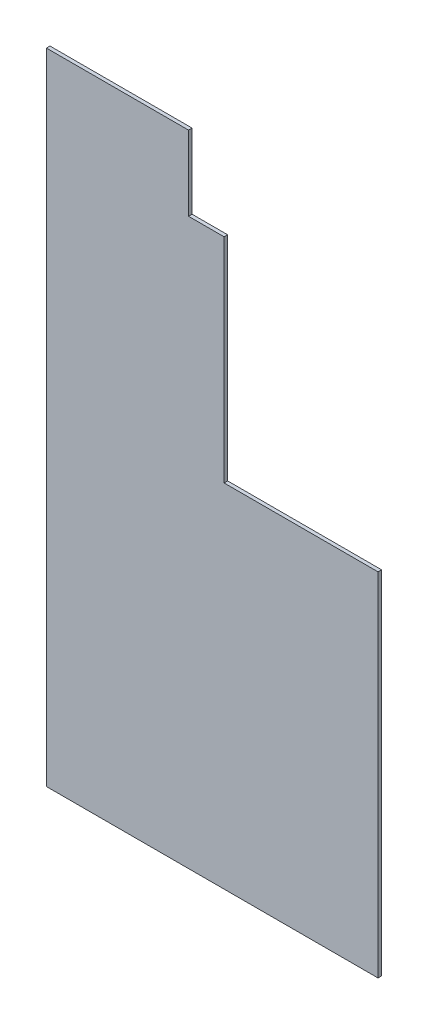
ISO-10303-21;
HEADER;
FILE_DESCRIPTION(('STEP AP214'),'2;1');
FILE_NAME('part.step','',(''),(''),'','','');
FILE_SCHEMA(('AUTOMOTIVE_DESIGN { 1 0 10303 214 1 1 1 1 }'));
ENDSEC;
DATA;
#1=APPLICATION_CONTEXT('core data for automotive mechanical design processes');
#2=APPLICATION_PROTOCOL_DEFINITION('international standard','automotive_design',2000,#1);
#3=PRODUCT_CONTEXT('',#1,'mechanical');
#4=PRODUCT('Part','Part','',(#3));
#5=PRODUCT_RELATED_PRODUCT_CATEGORY('part','',(#4));
#6=PRODUCT_DEFINITION_FORMATION('','',#4);
#7=PRODUCT_DEFINITION_CONTEXT('part definition',#1,'design');
#8=PRODUCT_DEFINITION('design','',#6,#7);
#9=PRODUCT_DEFINITION_SHAPE('','',#8);
#10=(LENGTH_UNIT() NAMED_UNIT(*) SI_UNIT(.MILLI.,.METRE.));
#11=(NAMED_UNIT(*) PLANE_ANGLE_UNIT() SI_UNIT($,.RADIAN.));
#12=(NAMED_UNIT(*) SI_UNIT($,.STERADIAN.) SOLID_ANGLE_UNIT());
#13=UNCERTAINTY_MEASURE_WITH_UNIT(LENGTH_MEASURE(1.E-05),#10,'distance_accuracy_value','');
#14=(GEOMETRIC_REPRESENTATION_CONTEXT(3) GLOBAL_UNCERTAINTY_ASSIGNED_CONTEXT((#13)) GLOBAL_UNIT_ASSIGNED_CONTEXT((#10,
#11,#12)) REPRESENTATION_CONTEXT('',''));
#15=CARTESIAN_POINT('',(0.,0.,0.));
#16=DIRECTION('',(0.,0.,1.));
#17=DIRECTION('',(1.,0.,0.));
#18=AXIS2_PLACEMENT_3D('',#15,#16,#17);
#19=CARTESIAN_POINT('',(-51.5388987090363,86.813499077883,3.));
#20=DIRECTION('',(1.,0.,0.));
#21=DIRECTION('',(0.,1.,0.));
#22=AXIS2_PLACEMENT_3D('',#19,#20,#21);
#23=PLANE('',#22);
#24=DIRECTION('',(0.,-1.,0.));
#25=VECTOR('',#24,1.);
#26=CARTESIAN_POINT('',(-51.5388987090363,86.813499077883,0.));
#27=LINE('',#26,#25);
#28=CARTESIAN_POINT('',(-51.5388987090363,86.813499077883,0.));
#29=VERTEX_POINT('',#28);
#30=CARTESIAN_POINT('',(-51.5388987090362,-453.186500922117,0.));
#31=VERTEX_POINT('',#30);
#32=EDGE_CURVE('E129',#29,#31,#27,.T.);
#33=ORIENTED_EDGE('',*,*,#32,.T.);
#34=DIRECTION('',(0.,0.,-1.));
#35=VECTOR('',#34,1.);
#36=CARTESIAN_POINT('',(-51.5388987090362,-453.186500922117,3.));
#37=LINE('',#36,#35);
#38=CARTESIAN_POINT('',(-51.5388987090362,-453.186500922117,3.));
#39=VERTEX_POINT('',#38);
#40=EDGE_CURVE('E11',#39,#31,#37,.T.);
#41=ORIENTED_EDGE('',*,*,#40,.F.);
#42=DIRECTION('',(0.,-1.,0.));
#43=VECTOR('',#42,1.);
#44=CARTESIAN_POINT('',(-51.5388987090363,86.813499077883,3.));
#45=LINE('',#44,#43);
#46=CARTESIAN_POINT('',(-51.5388987090363,86.813499077883,3.));
#47=VERTEX_POINT('',#46);
#48=EDGE_CURVE('E143',#47,#39,#45,.T.);
#49=ORIENTED_EDGE('',*,*,#48,.F.);
#50=DIRECTION('',(0.,0.,-1.));
#51=VECTOR('',#50,1.);
#52=CARTESIAN_POINT('',(-51.5388987090363,86.813499077883,3.));
#53=LINE('',#52,#51);
#54=EDGE_CURVE('E125',#47,#29,#53,.T.);
#55=ORIENTED_EDGE('',*,*,#54,.T.);
#56=EDGE_LOOP('',(#33,#41,#49,#55));
#57=FACE_BOUND('',#56,.T.);
#58=ADVANCED_FACE('F33',(#57),#23,.F.);
#59=CARTESIAN_POINT('',(-51.5388987090362,-453.186500922117,3.));
#60=DIRECTION('',(0.,1.,0.));
#61=DIRECTION('',(0.,0.,1.));
#62=AXIS2_PLACEMENT_3D('',#59,#60,#61);
#63=PLANE('',#62);
#64=DIRECTION('',(1.,0.,0.));
#65=VECTOR('',#64,1.);
#66=CARTESIAN_POINT('',(-51.5388987090362,-453.186500922117,0.));
#67=LINE('',#66,#65);
#68=CARTESIAN_POINT('',(228.461101290964,-453.186500922117,0.));
#69=VERTEX_POINT('',#68);
#70=EDGE_CURVE('E132',#31,#69,#67,.T.);
#71=ORIENTED_EDGE('',*,*,#70,.T.);
#72=DIRECTION('',(0.,0.,-1.));
#73=VECTOR('',#72,1.);
#74=CARTESIAN_POINT('',(228.461101290964,-453.186500922117,3.));
#75=LINE('',#74,#73);
#76=CARTESIAN_POINT('',(228.461101290964,-453.186500922117,3.));
#77=VERTEX_POINT('',#76);
#78=EDGE_CURVE('E41',#77,#69,#75,.T.);
#79=ORIENTED_EDGE('',*,*,#78,.F.);
#80=DIRECTION('',(1.,0.,0.));
#81=VECTOR('',#80,1.);
#82=CARTESIAN_POINT('',(-51.5388987090362,-453.186500922117,3.));
#83=LINE('',#82,#81);
#84=EDGE_CURVE('E92',#39,#77,#83,.T.);
#85=ORIENTED_EDGE('',*,*,#84,.F.);
#86=ORIENTED_EDGE('',*,*,#40,.T.);
#87=EDGE_LOOP('',(#71,#79,#85,#86));
#88=FACE_BOUND('',#87,.T.);
#89=ADVANCED_FACE('F178',(#88),#63,.F.);
#90=CARTESIAN_POINT('',(228.461101290964,-156.186500922117,3.));
#91=DIRECTION('',(-1.,0.,0.));
#92=DIRECTION('',(0.,-1.,0.));
#93=AXIS2_PLACEMENT_3D('',#90,#91,#92);
#94=PLANE('',#93);
#95=DIRECTION('',(0.,1.,0.));
#96=VECTOR('',#95,1.);
#97=CARTESIAN_POINT('',(228.461101290964,-156.186500922117,0.));
#98=LINE('',#97,#96);
#99=CARTESIAN_POINT('',(228.461101290964,-156.186500922117,0.));
#100=VERTEX_POINT('',#99);
#101=EDGE_CURVE('E134',#69,#100,#98,.T.);
#102=ORIENTED_EDGE('',*,*,#101,.T.);
#103=DIRECTION('',(0.,0.,-1.));
#104=VECTOR('',#103,1.);
#105=CARTESIAN_POINT('',(228.461101290964,-156.186500922117,3.));
#106=LINE('',#105,#104);
#107=CARTESIAN_POINT('',(228.461101290964,-156.186500922117,3.));
#108=VERTEX_POINT('',#107);
#109=EDGE_CURVE('E150',#108,#100,#106,.T.);
#110=ORIENTED_EDGE('',*,*,#109,.F.);
#111=DIRECTION('',(0.,1.,0.));
#112=VECTOR('',#111,1.);
#113=CARTESIAN_POINT('',(228.461101290964,-156.186500922117,3.));
#114=LINE('',#113,#112);
#115=EDGE_CURVE('E158',#77,#108,#114,.T.);
#116=ORIENTED_EDGE('',*,*,#115,.F.);
#117=ORIENTED_EDGE('',*,*,#78,.T.);
#118=EDGE_LOOP('',(#102,#110,#116,#117));
#119=FACE_BOUND('',#118,.T.);
#120=ADVANCED_FACE('F156',(#119),#94,.F.);
#121=CARTESIAN_POINT('',(98.4611012909638,-156.186500922117,3.));
#122=DIRECTION('',(0.,-1.,0.));
#123=DIRECTION('',(0.,0.,-1.));
#124=AXIS2_PLACEMENT_3D('',#121,#122,#123);
#125=PLANE('',#124);
#126=DIRECTION('',(-1.,0.,0.));
#127=VECTOR('',#126,1.);
#128=CARTESIAN_POINT('',(98.4611012909638,-156.186500922117,0.));
#129=LINE('',#128,#127);
#130=CARTESIAN_POINT('',(98.4611012909638,-156.186500922117,0.));
#131=VERTEX_POINT('',#130);
#132=EDGE_CURVE('E136',#100,#131,#129,.T.);
#133=ORIENTED_EDGE('',*,*,#132,.T.);
#134=DIRECTION('',(0.,0.,-1.));
#135=VECTOR('',#134,1.);
#136=CARTESIAN_POINT('',(98.4611012909638,-156.186500922117,3.));
#137=LINE('',#136,#135);
#138=CARTESIAN_POINT('',(98.4611012909638,-156.186500922117,3.));
#139=VERTEX_POINT('',#138);
#140=EDGE_CURVE('E147',#139,#131,#137,.T.);
#141=ORIENTED_EDGE('',*,*,#140,.F.);
#142=DIRECTION('',(-1.,0.,0.));
#143=VECTOR('',#142,1.);
#144=CARTESIAN_POINT('',(98.4611012909638,-156.186500922117,3.));
#145=LINE('',#144,#143);
#146=EDGE_CURVE('E170',#108,#139,#145,.T.);
#147=ORIENTED_EDGE('',*,*,#146,.F.);
#148=ORIENTED_EDGE('',*,*,#109,.T.);
#149=EDGE_LOOP('',(#133,#141,#147,#148));
#150=FACE_BOUND('',#149,.T.);
#151=ADVANCED_FACE('F166',(#150),#125,.F.);
#152=CARTESIAN_POINT('',(98.4611012909638,23.813499077883,3.));
#153=DIRECTION('',(-1.,0.,0.));
#154=DIRECTION('',(0.,-1.,0.));
#155=AXIS2_PLACEMENT_3D('',#152,#153,#154);
#156=PLANE('',#155);
#157=DIRECTION('',(0.,1.,0.));
#158=VECTOR('',#157,1.);
#159=CARTESIAN_POINT('',(98.4611012909638,23.813499077883,0.));
#160=LINE('',#159,#158);
#161=CARTESIAN_POINT('',(98.4611012909638,23.813499077883,0.));
#162=VERTEX_POINT('',#161);
#163=EDGE_CURVE('E138',#131,#162,#160,.T.);
#164=ORIENTED_EDGE('',*,*,#163,.T.);
#165=DIRECTION('',(0.,0.,-1.));
#166=VECTOR('',#165,1.);
#167=CARTESIAN_POINT('',(98.4611012909638,23.813499077883,3.));
#168=LINE('',#167,#166);
#169=CARTESIAN_POINT('',(98.4611012909638,23.813499077883,3.));
#170=VERTEX_POINT('',#169);
#171=EDGE_CURVE('E120',#170,#162,#168,.T.);
#172=ORIENTED_EDGE('',*,*,#171,.F.);
#173=DIRECTION('',(0.,1.,0.));
#174=VECTOR('',#173,1.);
#175=CARTESIAN_POINT('',(98.4611012909638,23.813499077883,3.));
#176=LINE('',#175,#174);
#177=EDGE_CURVE('E111',#139,#170,#176,.T.);
#178=ORIENTED_EDGE('',*,*,#177,.F.);
#179=ORIENTED_EDGE('',*,*,#140,.T.);
#180=EDGE_LOOP('',(#164,#172,#178,#179));
#181=FACE_BOUND('',#180,.T.);
#182=ADVANCED_FACE('F169',(#181),#156,.F.);
#183=CARTESIAN_POINT('',(98.4611012909638,23.813499077883,3.));
#184=DIRECTION('',(0.,-1.,0.));
#185=DIRECTION('',(0.,0.,-1.));
#186=AXIS2_PLACEMENT_3D('',#183,#184,#185);
#187=PLANE('',#186);
#188=DIRECTION('',(-1.,0.,0.));
#189=VECTOR('',#188,1.);
#190=CARTESIAN_POINT('',(98.4611012909638,23.813499077883,0.));
#191=LINE('',#190,#189);
#192=CARTESIAN_POINT('',(68.4611012909638,23.813499077883,0.));
#193=VERTEX_POINT('',#192);
#194=EDGE_CURVE('E119',#162,#193,#191,.T.);
#195=ORIENTED_EDGE('',*,*,#194,.T.);
#196=DIRECTION('',(0.,0.,-1.));
#197=VECTOR('',#196,1.);
#198=CARTESIAN_POINT('',(68.4611012909638,23.813499077883,3.));
#199=LINE('',#198,#197);
#200=CARTESIAN_POINT('',(68.4611012909638,23.813499077883,3.));
#201=VERTEX_POINT('',#200);
#202=EDGE_CURVE('E116',#201,#193,#199,.T.);
#203=ORIENTED_EDGE('',*,*,#202,.F.);
#204=DIRECTION('',(-1.,0.,0.));
#205=VECTOR('',#204,1.);
#206=CARTESIAN_POINT('',(98.4611012909638,23.813499077883,3.));
#207=LINE('',#206,#205);
#208=EDGE_CURVE('E105',#170,#201,#207,.T.);
#209=ORIENTED_EDGE('',*,*,#208,.F.);
#210=ORIENTED_EDGE('',*,*,#171,.T.);
#211=EDGE_LOOP('',(#195,#203,#209,#210));
#212=FACE_BOUND('',#211,.T.);
#213=ADVANCED_FACE('F117',(#212),#187,.F.);
#214=CARTESIAN_POINT('',(68.4611012909637,86.813499077883,3.));
#215=DIRECTION('',(-1.,0.,0.));
#216=DIRECTION('',(0.,-1.,0.));
#217=AXIS2_PLACEMENT_3D('',#214,#215,#216);
#218=PLANE('',#217);
#219=DIRECTION('',(0.,1.,0.));
#220=VECTOR('',#219,1.);
#221=CARTESIAN_POINT('',(68.4611012909637,86.813499077883,0.));
#222=LINE('',#221,#220);
#223=CARTESIAN_POINT('',(68.4611012909637,86.813499077883,0.));
#224=VERTEX_POINT('',#223);
#225=EDGE_CURVE('E78',#193,#224,#222,.T.);
#226=ORIENTED_EDGE('',*,*,#225,.T.);
#227=DIRECTION('',(0.,0.,-1.));
#228=VECTOR('',#227,1.);
#229=CARTESIAN_POINT('',(68.4611012909637,86.813499077883,3.));
#230=LINE('',#229,#228);
#231=CARTESIAN_POINT('',(68.4611012909637,86.813499077883,3.));
#232=VERTEX_POINT('',#231);
#233=EDGE_CURVE('E121',#232,#224,#230,.T.);
#234=ORIENTED_EDGE('',*,*,#233,.F.);
#235=DIRECTION('',(0.,1.,0.));
#236=VECTOR('',#235,1.);
#237=CARTESIAN_POINT('',(68.4611012909637,86.813499077883,3.));
#238=LINE('',#237,#236);
#239=EDGE_CURVE('E109',#201,#232,#238,.T.);
#240=ORIENTED_EDGE('',*,*,#239,.F.);
#241=ORIENTED_EDGE('',*,*,#202,.T.);
#242=EDGE_LOOP('',(#226,#234,#240,#241));
#243=FACE_BOUND('',#242,.T.);
#244=ADVANCED_FACE('F123',(#243),#218,.F.);
#245=CARTESIAN_POINT('',(-51.5388987090363,86.813499077883,3.));
#246=DIRECTION('',(0.,-1.,0.));
#247=DIRECTION('',(0.,0.,-1.));
#248=AXIS2_PLACEMENT_3D('',#245,#246,#247);
#249=PLANE('',#248);
#250=DIRECTION('',(-1.,0.,0.));
#251=VECTOR('',#250,1.);
#252=CARTESIAN_POINT('',(-51.5388987090363,86.813499077883,0.));
#253=LINE('',#252,#251);
#254=EDGE_CURVE('E84',#224,#29,#253,.T.);
#255=ORIENTED_EDGE('',*,*,#254,.T.);
#256=ORIENTED_EDGE('',*,*,#54,.F.);
#257=DIRECTION('',(-1.,0.,0.));
#258=VECTOR('',#257,1.);
#259=CARTESIAN_POINT('',(-51.5388987090363,86.813499077883,3.));
#260=LINE('',#259,#258);
#261=EDGE_CURVE('E49',#232,#47,#260,.T.);
#262=ORIENTED_EDGE('',*,*,#261,.F.);
#263=ORIENTED_EDGE('',*,*,#233,.T.);
#264=EDGE_LOOP('',(#255,#256,#262,#263));
#265=FACE_BOUND('',#264,.T.);
#266=ADVANCED_FACE('F194',(#265),#249,.F.);
#267=CARTESIAN_POINT('',(0.,0.,3.));
#268=DIRECTION('',(0.,0.,1.));
#269=DIRECTION('',(1.,0.,0.));
#270=AXIS2_PLACEMENT_3D('',#267,#268,#269);
#271=PLANE('',#270);
#272=ORIENTED_EDGE('',*,*,#48,.T.);
#273=ORIENTED_EDGE('',*,*,#84,.T.);
#274=ORIENTED_EDGE('',*,*,#115,.T.);
#275=ORIENTED_EDGE('',*,*,#146,.T.);
#276=ORIENTED_EDGE('',*,*,#177,.T.);
#277=ORIENTED_EDGE('',*,*,#208,.T.);
#278=ORIENTED_EDGE('',*,*,#239,.T.);
#279=ORIENTED_EDGE('',*,*,#261,.T.);
#280=EDGE_LOOP('',(#272,#273,#274,#275,#276,#277,#278,#279));
#281=FACE_BOUND('',#280,.T.);
#282=ADVANCED_FACE('F107',(#281),#271,.T.);
#283=CARTESIAN_POINT('',(0.,0.,0.));
#284=DIRECTION('',(0.,0.,1.));
#285=DIRECTION('',(1.,0.,0.));
#286=AXIS2_PLACEMENT_3D('',#283,#284,#285);
#287=PLANE('',#286);
#288=ORIENTED_EDGE('',*,*,#32,.F.);
#289=ORIENTED_EDGE('',*,*,#254,.F.);
#290=ORIENTED_EDGE('',*,*,#225,.F.);
#291=ORIENTED_EDGE('',*,*,#194,.F.);
#292=ORIENTED_EDGE('',*,*,#163,.F.);
#293=ORIENTED_EDGE('',*,*,#132,.F.);
#294=ORIENTED_EDGE('',*,*,#101,.F.);
#295=ORIENTED_EDGE('',*,*,#70,.F.);
#296=EDGE_LOOP('',(#288,#289,#290,#291,#292,#293,#294,#295));
#297=FACE_BOUND('',#296,.T.);
#298=ADVANCED_FACE('F162',(#297),#287,.F.);
#299=CLOSED_SHELL('',(#58,#89,#120,#151,#182,#213,#244,#266,#282,#298));
#300=MANIFOLD_SOLID_BREP('B2',#299);
#301=ADVANCED_BREP_SHAPE_REPRESENTATION('',(#18,#300),#14);
#302=SHAPE_DEFINITION_REPRESENTATION(#9,#301);
ENDSEC;
END-ISO-10303-21;
